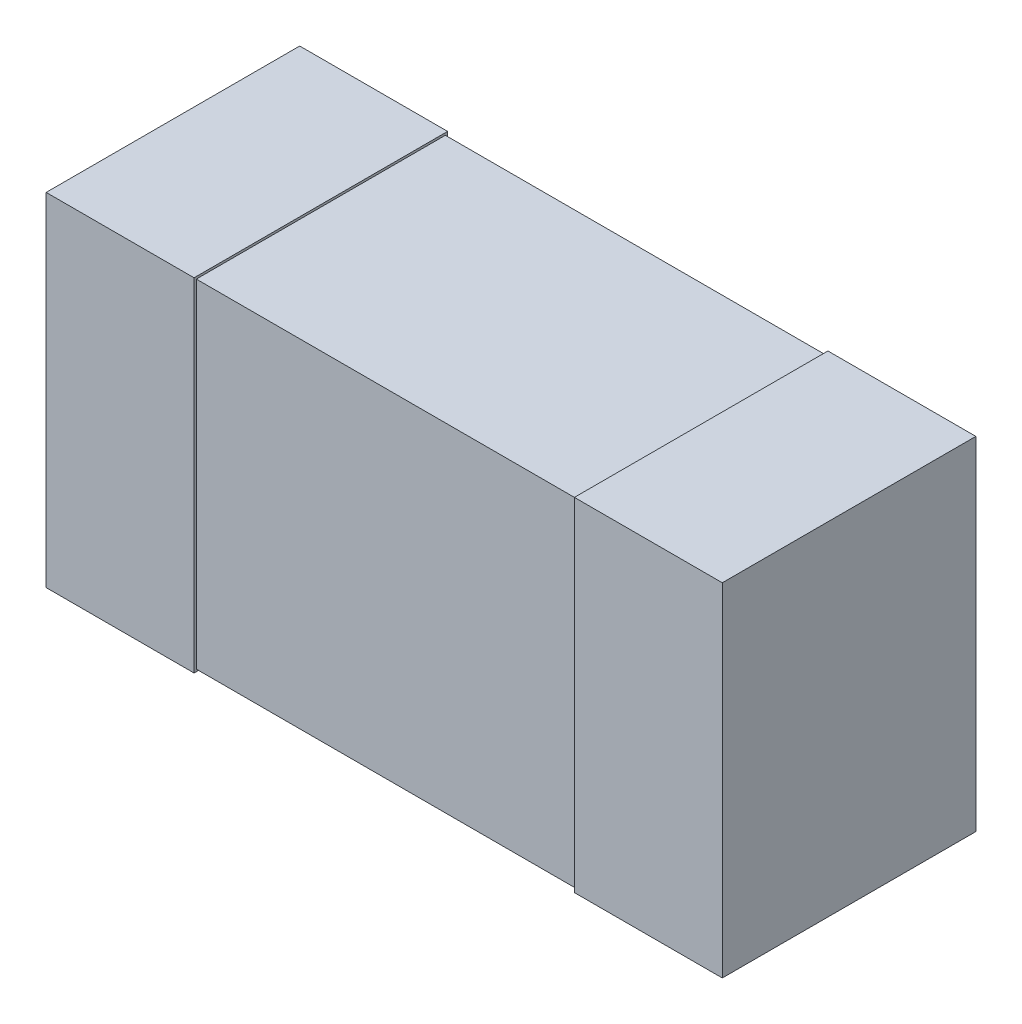
ISO-10303-21;
HEADER;
FILE_DESCRIPTION(('STEP AP214'),'2;1');
FILE_NAME('part.step','',(''),(''),'','','');
FILE_SCHEMA(('AUTOMOTIVE_DESIGN { 1 0 10303 214 1 1 1 1 }'));
ENDSEC;
DATA;
#1=APPLICATION_CONTEXT('core data for automotive mechanical design processes');
#2=APPLICATION_PROTOCOL_DEFINITION('international standard','automotive_design',2000,#1);
#3=PRODUCT_CONTEXT('',#1,'mechanical');
#4=PRODUCT('Part','Part','',(#3));
#5=PRODUCT_RELATED_PRODUCT_CATEGORY('part','',(#4));
#6=PRODUCT_DEFINITION_FORMATION('','',#4);
#7=PRODUCT_DEFINITION_CONTEXT('part definition',#1,'design');
#8=PRODUCT_DEFINITION('design','',#6,#7);
#9=PRODUCT_DEFINITION_SHAPE('','',#8);
#10=(LENGTH_UNIT() NAMED_UNIT(*) SI_UNIT(.MILLI.,.METRE.));
#11=(NAMED_UNIT(*) PLANE_ANGLE_UNIT() SI_UNIT($,.RADIAN.));
#12=(NAMED_UNIT(*) SI_UNIT($,.STERADIAN.) SOLID_ANGLE_UNIT());
#13=UNCERTAINTY_MEASURE_WITH_UNIT(LENGTH_MEASURE(1.E-05),#10,'distance_accuracy_value','');
#14=(GEOMETRIC_REPRESENTATION_CONTEXT(3) GLOBAL_UNCERTAINTY_ASSIGNED_CONTEXT((#13)) GLOBAL_UNIT_ASSIGNED_CONTEXT((#10,
#11,#12)) REPRESENTATION_CONTEXT('',''));
#15=CARTESIAN_POINT('',(0.,0.,0.));
#16=DIRECTION('',(0.,0.,1.));
#17=DIRECTION('',(1.,0.,0.));
#18=AXIS2_PLACEMENT_3D('',#15,#16,#17);
#19=CARTESIAN_POINT('',(0.8,-0.405,0.0762));
#20=DIRECTION('',(1.,0.,0.));
#21=DIRECTION('',(0.,0.,-1.));
#22=AXIS2_PLACEMENT_3D('',#19,#20,#21);
#23=PLANE('',#22);
#24=DIRECTION('',(0.,0.,-1.));
#25=VECTOR('',#24,1.);
#26=CARTESIAN_POINT('',(0.8,-0.405,0.0762));
#27=LINE('',#26,#25);
#28=CARTESIAN_POINT('',(0.8,-0.405,0.0762));
#29=VERTEX_POINT('',#28);
#30=CARTESIAN_POINT('',(0.8,-0.405,0.6762));
#31=VERTEX_POINT('',#30);
#32=EDGE_CURVE('E118',#29,#31,#27,.F.);
#33=ORIENTED_EDGE('',*,*,#32,.F.);
#34=DIRECTION('',(0.,1.,0.));
#35=VECTOR('',#34,1.);
#36=CARTESIAN_POINT('',(0.8,0.,0.0762));
#37=LINE('',#36,#35);
#38=CARTESIAN_POINT('',(0.8,0.405,0.0762));
#39=VERTEX_POINT('',#38);
#40=EDGE_CURVE('E20',#29,#39,#37,.T.);
#41=ORIENTED_EDGE('',*,*,#40,.T.);
#42=DIRECTION('',(0.,0.,1.));
#43=VECTOR('',#42,1.);
#44=CARTESIAN_POINT('',(0.8,0.405,0.0762));
#45=LINE('',#44,#43);
#46=CARTESIAN_POINT('',(0.8,0.405,0.6762));
#47=VERTEX_POINT('',#46);
#48=EDGE_CURVE('E108',#47,#39,#45,.F.);
#49=ORIENTED_EDGE('',*,*,#48,.F.);
#50=DIRECTION('',(0.,1.,0.));
#51=VECTOR('',#50,1.);
#52=CARTESIAN_POINT('',(0.8,0.,0.6762));
#53=LINE('',#52,#51);
#54=EDGE_CURVE('E103',#31,#47,#53,.T.);
#55=ORIENTED_EDGE('',*,*,#54,.F.);
#56=EDGE_LOOP('',(#33,#41,#49,#55));
#57=FACE_BOUND('',#56,.T.);
#58=ADVANCED_FACE('F17',(#57),#23,.T.);
#59=CARTESIAN_POINT('',(-0.8,0.405,0.0762));
#60=DIRECTION('',(-1.,0.,0.));
#61=DIRECTION('',(0.,0.,1.));
#62=AXIS2_PLACEMENT_3D('',#59,#60,#61);
#63=PLANE('',#62);
#64=DIRECTION('',(0.,0.,1.));
#65=VECTOR('',#64,1.);
#66=CARTESIAN_POINT('',(-0.8,0.405,0.0762));
#67=LINE('',#66,#65);
#68=CARTESIAN_POINT('',(-0.8,0.405,0.0762));
#69=VERTEX_POINT('',#68);
#70=CARTESIAN_POINT('',(-0.8,0.405,0.6762));
#71=VERTEX_POINT('',#70);
#72=EDGE_CURVE('E148',#69,#71,#67,.T.);
#73=ORIENTED_EDGE('',*,*,#72,.F.);
#74=DIRECTION('',(0.,1.,0.));
#75=VECTOR('',#74,1.);
#76=CARTESIAN_POINT('',(-0.8,0.,0.0762));
#77=LINE('',#76,#75);
#78=CARTESIAN_POINT('',(-0.8,-0.405,0.0762));
#79=VERTEX_POINT('',#78);
#80=EDGE_CURVE('E134',#69,#79,#77,.F.);
#81=ORIENTED_EDGE('',*,*,#80,.T.);
#82=DIRECTION('',(0.,0.,-1.));
#83=VECTOR('',#82,1.);
#84=CARTESIAN_POINT('',(-0.8,-0.405,0.0762));
#85=LINE('',#84,#83);
#86=CARTESIAN_POINT('',(-0.8,-0.405,0.6762));
#87=VERTEX_POINT('',#86);
#88=EDGE_CURVE('E137',#87,#79,#85,.T.);
#89=ORIENTED_EDGE('',*,*,#88,.F.);
#90=DIRECTION('',(0.,1.,0.));
#91=VECTOR('',#90,1.);
#92=CARTESIAN_POINT('',(-0.8,0.,0.6762));
#93=LINE('',#92,#91);
#94=EDGE_CURVE('E141',#71,#87,#93,.F.);
#95=ORIENTED_EDGE('',*,*,#94,.F.);
#96=EDGE_LOOP('',(#73,#81,#89,#95));
#97=FACE_BOUND('',#96,.T.);
#98=ADVANCED_FACE('F236',(#97),#63,.T.);
#99=CARTESIAN_POINT('',(0.,0.,0.0762));
#100=DIRECTION('',(0.,0.,1.));
#101=DIRECTION('',(1.,0.,0.));
#102=AXIS2_PLACEMENT_3D('',#99,#100,#101);
#103=PLANE('',#102);
#104=ORIENTED_EDGE('',*,*,#40,.F.);
#105=DIRECTION('',(1.,0.,0.));
#106=VECTOR('',#105,1.);
#107=CARTESIAN_POINT('',(-0.8,-0.405,0.0762));
#108=LINE('',#107,#106);
#109=CARTESIAN_POINT('',(0.45,-0.405,0.0762));
#110=VERTEX_POINT('',#109);
#111=EDGE_CURVE('E129',#110,#29,#108,.T.);
#112=ORIENTED_EDGE('',*,*,#111,.F.);
#113=DIRECTION('',(0.,1.,0.));
#114=VECTOR('',#113,1.);
#115=CARTESIAN_POINT('',(0.45,-0.405,0.0762));
#116=LINE('',#115,#114);
#117=CARTESIAN_POINT('',(0.45,0.405,0.0762));
#118=VERTEX_POINT('',#117);
#119=EDGE_CURVE('E124',#110,#118,#116,.T.);
#120=ORIENTED_EDGE('',*,*,#119,.T.);
#121=DIRECTION('',(1.,0.,0.));
#122=VECTOR('',#121,1.);
#123=CARTESIAN_POINT('',(0.8,0.405,0.0762));
#124=LINE('',#123,#122);
#125=EDGE_CURVE('E113',#39,#118,#124,.F.);
#126=ORIENTED_EDGE('',*,*,#125,.F.);
#127=EDGE_LOOP('',(#104,#112,#120,#126));
#128=FACE_BOUND('',#127,.T.);
#129=ADVANCED_FACE('F123',(#128),#103,.F.);
#130=CARTESIAN_POINT('',(0.8,0.405,0.0762));
#131=DIRECTION('',(0.,1.,0.));
#132=DIRECTION('',(0.,0.,1.));
#133=AXIS2_PLACEMENT_3D('',#130,#131,#132);
#134=PLANE('',#133);
#135=ORIENTED_EDGE('',*,*,#125,.T.);
#136=DIRECTION('',(0.,0.,-1.));
#137=VECTOR('',#136,1.);
#138=CARTESIAN_POINT('',(0.45,0.405,0.081534));
#139=LINE('',#138,#137);
#140=CARTESIAN_POINT('',(0.45,0.405,0.6762));
#141=VERTEX_POINT('',#140);
#142=EDGE_CURVE('E156',#118,#141,#139,.F.);
#143=ORIENTED_EDGE('',*,*,#142,.T.);
#144=DIRECTION('',(1.,0.,0.));
#145=VECTOR('',#144,1.);
#146=CARTESIAN_POINT('',(0.,0.405,0.6762));
#147=LINE('',#146,#145);
#148=EDGE_CURVE('E115',#47,#141,#147,.F.);
#149=ORIENTED_EDGE('',*,*,#148,.F.);
#150=ORIENTED_EDGE('',*,*,#48,.T.);
#151=EDGE_LOOP('',(#135,#143,#149,#150));
#152=FACE_BOUND('',#151,.T.);
#153=ADVANCED_FACE('F110',(#152),#134,.T.);
#154=CARTESIAN_POINT('',(0.,0.,0.6762));
#155=DIRECTION('',(0.,0.,1.));
#156=DIRECTION('',(1.,0.,0.));
#157=AXIS2_PLACEMENT_3D('',#154,#155,#156);
#158=PLANE('',#157);
#159=ORIENTED_EDGE('',*,*,#148,.T.);
#160=DIRECTION('',(0.,1.,0.));
#161=VECTOR('',#160,1.);
#162=CARTESIAN_POINT('',(0.45,-0.405,0.6762));
#163=LINE('',#162,#161);
#164=CARTESIAN_POINT('',(0.45,-0.405,0.6762));
#165=VERTEX_POINT('',#164);
#166=EDGE_CURVE('E158',#141,#165,#163,.F.);
#167=ORIENTED_EDGE('',*,*,#166,.T.);
#168=DIRECTION('',(1.,0.,0.));
#169=VECTOR('',#168,1.);
#170=CARTESIAN_POINT('',(-0.8,-0.405,0.6762));
#171=LINE('',#170,#169);
#172=EDGE_CURVE('E132',#31,#165,#171,.F.);
#173=ORIENTED_EDGE('',*,*,#172,.F.);
#174=ORIENTED_EDGE('',*,*,#54,.T.);
#175=EDGE_LOOP('',(#159,#167,#173,#174));
#176=FACE_BOUND('',#175,.T.);
#177=ADVANCED_FACE('F270',(#176),#158,.T.);
#178=CARTESIAN_POINT('',(-0.8,-0.405,0.0762));
#179=DIRECTION('',(0.,-1.,0.));
#180=DIRECTION('',(0.,0.,-1.));
#181=AXIS2_PLACEMENT_3D('',#178,#179,#180);
#182=PLANE('',#181);
#183=ORIENTED_EDGE('',*,*,#172,.T.);
#184=DIRECTION('',(0.,0.,-1.));
#185=VECTOR('',#184,1.);
#186=CARTESIAN_POINT('',(0.45,-0.405,0.081534));
#187=LINE('',#186,#185);
#188=EDGE_CURVE('E161',#165,#110,#187,.T.);
#189=ORIENTED_EDGE('',*,*,#188,.T.);
#190=ORIENTED_EDGE('',*,*,#111,.T.);
#191=ORIENTED_EDGE('',*,*,#32,.T.);
#192=EDGE_LOOP('',(#183,#189,#190,#191));
#193=FACE_BOUND('',#192,.T.);
#194=ADVANCED_FACE('F267',(#193),#182,.T.);
#195=CARTESIAN_POINT('',(0.,0.,0.0762));
#196=DIRECTION('',(0.,0.,1.));
#197=DIRECTION('',(1.,0.,0.));
#198=AXIS2_PLACEMENT_3D('',#195,#196,#197);
#199=PLANE('',#198);
#200=ORIENTED_EDGE('',*,*,#80,.F.);
#201=DIRECTION('',(1.,0.,0.));
#202=VECTOR('',#201,1.);
#203=CARTESIAN_POINT('',(0.8,0.405,0.0762));
#204=LINE('',#203,#202);
#205=CARTESIAN_POINT('',(-0.45,0.405,0.0762));
#206=VERTEX_POINT('',#205);
#207=EDGE_CURVE('E145',#206,#69,#204,.F.);
#208=ORIENTED_EDGE('',*,*,#207,.F.);
#209=DIRECTION('',(0.,1.,0.));
#210=VECTOR('',#209,1.);
#211=CARTESIAN_POINT('',(-0.45,-0.405,0.0762));
#212=LINE('',#211,#210);
#213=CARTESIAN_POINT('',(-0.45,-0.405,0.0762));
#214=VERTEX_POINT('',#213);
#215=EDGE_CURVE('E174',#206,#214,#212,.F.);
#216=ORIENTED_EDGE('',*,*,#215,.T.);
#217=DIRECTION('',(1.,0.,0.));
#218=VECTOR('',#217,1.);
#219=CARTESIAN_POINT('',(-0.8,-0.405,0.0762));
#220=LINE('',#219,#218);
#221=EDGE_CURVE('E139',#79,#214,#220,.T.);
#222=ORIENTED_EDGE('',*,*,#221,.F.);
#223=EDGE_LOOP('',(#200,#208,#216,#222));
#224=FACE_BOUND('',#223,.T.);
#225=ADVANCED_FACE('F228',(#224),#199,.F.);
#226=CARTESIAN_POINT('',(-0.8,-0.405,0.0762));
#227=DIRECTION('',(0.,-1.,0.));
#228=DIRECTION('',(0.,0.,-1.));
#229=AXIS2_PLACEMENT_3D('',#226,#227,#228);
#230=PLANE('',#229);
#231=ORIENTED_EDGE('',*,*,#221,.T.);
#232=DIRECTION('',(0.,0.,1.));
#233=VECTOR('',#232,1.);
#234=CARTESIAN_POINT('',(-0.45,-0.405,0.0762));
#235=LINE('',#234,#233);
#236=CARTESIAN_POINT('',(-0.45,-0.405,0.6762));
#237=VERTEX_POINT('',#236);
#238=EDGE_CURVE('E177',#214,#237,#235,.T.);
#239=ORIENTED_EDGE('',*,*,#238,.T.);
#240=DIRECTION('',(1.,0.,0.));
#241=VECTOR('',#240,1.);
#242=CARTESIAN_POINT('',(0.,-0.405,0.6762));
#243=LINE('',#242,#241);
#244=EDGE_CURVE('E143',#87,#237,#243,.T.);
#245=ORIENTED_EDGE('',*,*,#244,.F.);
#246=ORIENTED_EDGE('',*,*,#88,.T.);
#247=EDGE_LOOP('',(#231,#239,#245,#246));
#248=FACE_BOUND('',#247,.T.);
#249=ADVANCED_FACE('F224',(#248),#230,.T.);
#250=CARTESIAN_POINT('',(0.,0.,0.6762));
#251=DIRECTION('',(0.,0.,1.));
#252=DIRECTION('',(1.,0.,0.));
#253=AXIS2_PLACEMENT_3D('',#250,#251,#252);
#254=PLANE('',#253);
#255=ORIENTED_EDGE('',*,*,#244,.T.);
#256=DIRECTION('',(0.,1.,0.));
#257=VECTOR('',#256,1.);
#258=CARTESIAN_POINT('',(-0.45,-0.405,0.6762));
#259=LINE('',#258,#257);
#260=CARTESIAN_POINT('',(-0.45,0.405,0.6762));
#261=VERTEX_POINT('',#260);
#262=EDGE_CURVE('E180',#237,#261,#259,.T.);
#263=ORIENTED_EDGE('',*,*,#262,.T.);
#264=DIRECTION('',(1.,0.,0.));
#265=VECTOR('',#264,1.);
#266=CARTESIAN_POINT('',(0.8,0.405,0.6762));
#267=LINE('',#266,#265);
#268=EDGE_CURVE('E150',#71,#261,#267,.T.);
#269=ORIENTED_EDGE('',*,*,#268,.F.);
#270=ORIENTED_EDGE('',*,*,#94,.T.);
#271=EDGE_LOOP('',(#255,#263,#269,#270));
#272=FACE_BOUND('',#271,.T.);
#273=ADVANCED_FACE('F234',(#272),#254,.T.);
#274=CARTESIAN_POINT('',(0.8,0.405,0.0762));
#275=DIRECTION('',(0.,1.,0.));
#276=DIRECTION('',(0.,0.,1.));
#277=AXIS2_PLACEMENT_3D('',#274,#275,#276);
#278=PLANE('',#277);
#279=ORIENTED_EDGE('',*,*,#268,.T.);
#280=DIRECTION('',(0.,0.,1.));
#281=VECTOR('',#280,1.);
#282=CARTESIAN_POINT('',(-0.45,0.405,0.0762));
#283=LINE('',#282,#281);
#284=EDGE_CURVE('E183',#261,#206,#283,.F.);
#285=ORIENTED_EDGE('',*,*,#284,.T.);
#286=ORIENTED_EDGE('',*,*,#207,.T.);
#287=ORIENTED_EDGE('',*,*,#72,.T.);
#288=EDGE_LOOP('',(#279,#285,#286,#287));
#289=FACE_BOUND('',#288,.T.);
#290=ADVANCED_FACE('F232',(#289),#278,.T.);
#291=CARTESIAN_POINT('',(-0.45,-0.405,0.081534));
#292=DIRECTION('',(0.,0.,1.));
#293=DIRECTION('',(1.,0.,0.));
#294=AXIS2_PLACEMENT_3D('',#291,#292,#293);
#295=PLANE('',#294);
#296=DIRECTION('',(1.,0.,0.));
#297=VECTOR('',#296,1.);
#298=CARTESIAN_POINT('',(-0.45,0.399666,0.081534));
#299=LINE('',#298,#297);
#300=CARTESIAN_POINT('',(-0.45,0.399666,0.081534));
#301=VERTEX_POINT('',#300);
#302=CARTESIAN_POINT('',(0.45,0.399666,0.081534));
#303=VERTEX_POINT('',#302);
#304=EDGE_CURVE('E152',#301,#303,#299,.T.);
#305=ORIENTED_EDGE('',*,*,#304,.T.);
#306=DIRECTION('',(0.,1.,0.));
#307=VECTOR('',#306,1.);
#308=CARTESIAN_POINT('',(0.45,-0.405,0.081534));
#309=LINE('',#308,#307);
#310=CARTESIAN_POINT('',(0.45,-0.399666,0.081534));
#311=VERTEX_POINT('',#310);
#312=EDGE_CURVE('E164',#303,#311,#309,.F.);
#313=ORIENTED_EDGE('',*,*,#312,.T.);
#314=DIRECTION('',(1.,0.,0.));
#315=VECTOR('',#314,1.);
#316=CARTESIAN_POINT('',(-0.45,-0.399666,0.081534));
#317=LINE('',#316,#315);
#318=CARTESIAN_POINT('',(-0.45,-0.399666,0.081534));
#319=VERTEX_POINT('',#318);
#320=EDGE_CURVE('E172',#311,#319,#317,.F.);
#321=ORIENTED_EDGE('',*,*,#320,.T.);
#322=DIRECTION('',(0.,1.,0.));
#323=VECTOR('',#322,1.);
#324=CARTESIAN_POINT('',(-0.45,-0.405,0.081534));
#325=LINE('',#324,#323);
#326=EDGE_CURVE('E187',#319,#301,#325,.T.);
#327=ORIENTED_EDGE('',*,*,#326,.T.);
#328=EDGE_LOOP('',(#305,#313,#321,#327));
#329=FACE_BOUND('',#328,.T.);
#330=ADVANCED_FACE('F255',(#329),#295,.F.);
#331=CARTESIAN_POINT('',(-0.45,0.399666,0.0762));
#332=DIRECTION('',(0.,-1.,0.));
#333=DIRECTION('',(0.,0.,-1.));
#334=AXIS2_PLACEMENT_3D('',#331,#332,#333);
#335=PLANE('',#334);
#336=DIRECTION('',(-1.,0.,0.));
#337=VECTOR('',#336,1.);
#338=CARTESIAN_POINT('',(-0.45,0.399666,0.670866));
#339=LINE('',#338,#337);
#340=CARTESIAN_POINT('',(-0.45,0.399666,0.670866));
#341=VERTEX_POINT('',#340);
#342=CARTESIAN_POINT('',(0.45,0.399666,0.670866));
#343=VERTEX_POINT('',#342);
#344=EDGE_CURVE('E193',#341,#343,#339,.F.);
#345=ORIENTED_EDGE('',*,*,#344,.T.);
#346=DIRECTION('',(0.,0.,-1.));
#347=VECTOR('',#346,1.);
#348=CARTESIAN_POINT('',(0.45,0.399666,0.081534));
#349=LINE('',#348,#347);
#350=EDGE_CURVE('E166',#343,#303,#349,.T.);
#351=ORIENTED_EDGE('',*,*,#350,.T.);
#352=ORIENTED_EDGE('',*,*,#304,.F.);
#353=DIRECTION('',(0.,0.,1.));
#354=VECTOR('',#353,1.);
#355=CARTESIAN_POINT('',(-0.45,0.399666,0.0762));
#356=LINE('',#355,#354);
#357=EDGE_CURVE('E190',#301,#341,#356,.T.);
#358=ORIENTED_EDGE('',*,*,#357,.T.);
#359=EDGE_LOOP('',(#345,#351,#352,#358));
#360=FACE_BOUND('',#359,.T.);
#361=ADVANCED_FACE('F211',(#360),#335,.F.);
#362=CARTESIAN_POINT('',(0.45,-0.405,0.081534));
#363=DIRECTION('',(1.,0.,0.));
#364=DIRECTION('',(0.,0.,-1.));
#365=AXIS2_PLACEMENT_3D('',#362,#363,#364);
#366=PLANE('',#365);
#367=DIRECTION('',(0.,1.,0.));
#368=VECTOR('',#367,1.);
#369=CARTESIAN_POINT('',(0.45,0.405,0.670866));
#370=LINE('',#369,#368);
#371=CARTESIAN_POINT('',(0.45,-0.399666,0.670866));
#372=VERTEX_POINT('',#371);
#373=EDGE_CURVE('E196',#343,#372,#370,.F.);
#374=ORIENTED_EDGE('',*,*,#373,.T.);
#375=DIRECTION('',(0.,0.,1.));
#376=VECTOR('',#375,1.);
#377=CARTESIAN_POINT('',(0.45,-0.399666,0.6762));
#378=LINE('',#377,#376);
#379=EDGE_CURVE('E169',#372,#311,#378,.F.);
#380=ORIENTED_EDGE('',*,*,#379,.T.);
#381=ORIENTED_EDGE('',*,*,#312,.F.);
#382=ORIENTED_EDGE('',*,*,#350,.F.);
#383=EDGE_LOOP('',(#374,#380,#381,#382));
#384=FACE_BOUND('',#383,.T.);
#385=ORIENTED_EDGE('',*,*,#166,.F.);
#386=ORIENTED_EDGE('',*,*,#142,.F.);
#387=ORIENTED_EDGE('',*,*,#119,.F.);
#388=ORIENTED_EDGE('',*,*,#188,.F.);
#389=EDGE_LOOP('',(#385,#386,#387,#388));
#390=FACE_BOUND('',#389,.T.);
#391=ADVANCED_FACE('F208',(#384,#390),#366,.F.);
#392=CARTESIAN_POINT('',(-0.45,-0.399666,0.6762));
#393=DIRECTION('',(0.,1.,0.));
#394=DIRECTION('',(0.,0.,1.));
#395=AXIS2_PLACEMENT_3D('',#392,#393,#394);
#396=PLANE('',#395);
#397=ORIENTED_EDGE('',*,*,#320,.F.);
#398=ORIENTED_EDGE('',*,*,#379,.F.);
#399=DIRECTION('',(-1.,0.,0.));
#400=VECTOR('',#399,1.);
#401=CARTESIAN_POINT('',(-0.45,-0.399666,0.670866));
#402=LINE('',#401,#400);
#403=CARTESIAN_POINT('',(-0.45,-0.399666,0.670866));
#404=VERTEX_POINT('',#403);
#405=EDGE_CURVE('E26',#372,#404,#402,.T.);
#406=ORIENTED_EDGE('',*,*,#405,.T.);
#407=DIRECTION('',(0.,0.,1.));
#408=VECTOR('',#407,1.);
#409=CARTESIAN_POINT('',(-0.45,-0.399666,0.0762));
#410=LINE('',#409,#408);
#411=EDGE_CURVE('E34',#404,#319,#410,.F.);
#412=ORIENTED_EDGE('',*,*,#411,.T.);
#413=EDGE_LOOP('',(#397,#398,#406,#412));
#414=FACE_BOUND('',#413,.T.);
#415=ADVANCED_FACE('F203',(#414),#396,.F.);
#416=CARTESIAN_POINT('',(-0.45,-0.405,0.0762));
#417=DIRECTION('',(-1.,0.,0.));
#418=DIRECTION('',(0.,0.,1.));
#419=AXIS2_PLACEMENT_3D('',#416,#417,#418);
#420=PLANE('',#419);
#421=ORIENTED_EDGE('',*,*,#357,.F.);
#422=ORIENTED_EDGE('',*,*,#326,.F.);
#423=ORIENTED_EDGE('',*,*,#411,.F.);
#424=DIRECTION('',(0.,1.,0.));
#425=VECTOR('',#424,1.);
#426=CARTESIAN_POINT('',(-0.45,0.405,0.670866));
#427=LINE('',#426,#425);
#428=EDGE_CURVE('E11',#404,#341,#427,.T.);
#429=ORIENTED_EDGE('',*,*,#428,.T.);
#430=EDGE_LOOP('',(#421,#422,#423,#429));
#431=FACE_BOUND('',#430,.T.);
#432=ORIENTED_EDGE('',*,*,#262,.F.);
#433=ORIENTED_EDGE('',*,*,#238,.F.);
#434=ORIENTED_EDGE('',*,*,#215,.F.);
#435=ORIENTED_EDGE('',*,*,#284,.F.);
#436=EDGE_LOOP('',(#432,#433,#434,#435));
#437=FACE_BOUND('',#436,.T.);
#438=ADVANCED_FACE('F213',(#431,#437),#420,.F.);
#439=CARTESIAN_POINT('',(-0.45,0.405,0.670866));
#440=DIRECTION('',(0.,0.,-1.));
#441=DIRECTION('',(-1.,0.,0.));
#442=AXIS2_PLACEMENT_3D('',#439,#440,#441);
#443=PLANE('',#442);
#444=ORIENTED_EDGE('',*,*,#405,.F.);
#445=ORIENTED_EDGE('',*,*,#373,.F.);
#446=ORIENTED_EDGE('',*,*,#344,.F.);
#447=ORIENTED_EDGE('',*,*,#428,.F.);
#448=EDGE_LOOP('',(#444,#445,#446,#447));
#449=FACE_BOUND('',#448,.T.);
#450=ADVANCED_FACE('F206',(#449),#443,.F.);
#451=CLOSED_SHELL('',(#58,#98,#129,#153,#177,#194,#225,#249,#273,#290,#330,#361,#391,#415,#438,#450));
#452=MANIFOLD_SOLID_BREP('B1',#451);
#453=ADVANCED_BREP_SHAPE_REPRESENTATION('',(#18,#452),#14);
#454=SHAPE_DEFINITION_REPRESENTATION(#9,#453);
ENDSEC;
END-ISO-10303-21;
